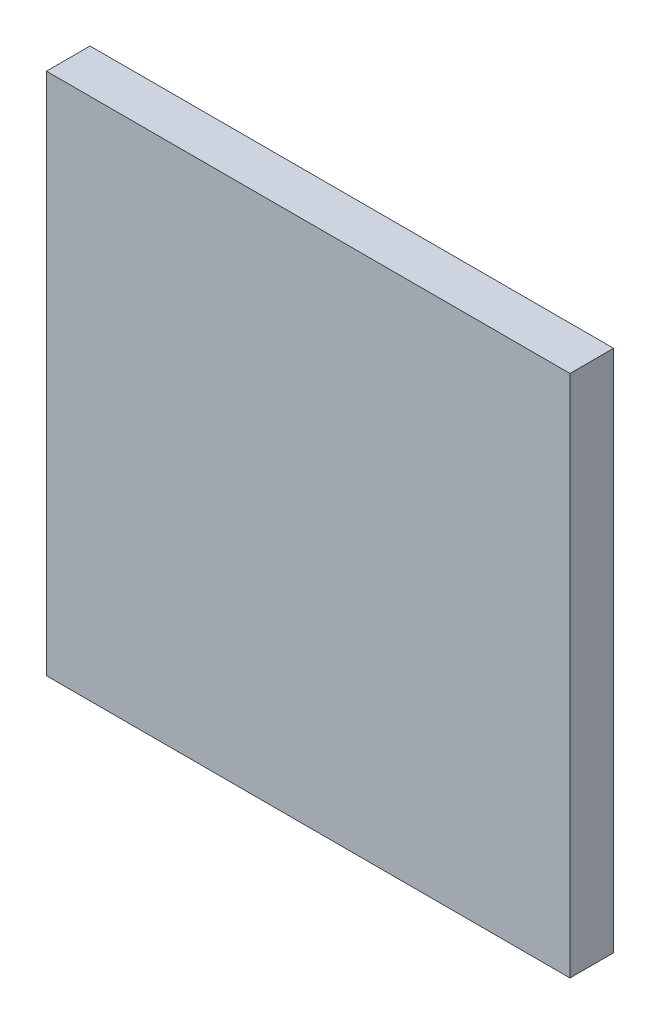
ISO-10303-21;
HEADER;
FILE_DESCRIPTION(('STEP AP214'),'2;1');
FILE_NAME('part.step','',(''),(''),'','','');
FILE_SCHEMA(('AUTOMOTIVE_DESIGN { 1 0 10303 214 1 1 1 1 }'));
ENDSEC;
DATA;
#1=APPLICATION_CONTEXT('core data for automotive mechanical design processes');
#2=APPLICATION_PROTOCOL_DEFINITION('international standard','automotive_design',2000,#1);
#3=PRODUCT_CONTEXT('',#1,'mechanical');
#4=PRODUCT('Part','Part','',(#3));
#5=PRODUCT_RELATED_PRODUCT_CATEGORY('part','',(#4));
#6=PRODUCT_DEFINITION_FORMATION('','',#4);
#7=PRODUCT_DEFINITION_CONTEXT('part definition',#1,'design');
#8=PRODUCT_DEFINITION('design','',#6,#7);
#9=PRODUCT_DEFINITION_SHAPE('','',#8);
#10=(LENGTH_UNIT() NAMED_UNIT(*) SI_UNIT(.MILLI.,.METRE.));
#11=(NAMED_UNIT(*) PLANE_ANGLE_UNIT() SI_UNIT($,.RADIAN.));
#12=(NAMED_UNIT(*) SI_UNIT($,.STERADIAN.) SOLID_ANGLE_UNIT());
#13=UNCERTAINTY_MEASURE_WITH_UNIT(LENGTH_MEASURE(1.E-05),#10,'distance_accuracy_value','');
#14=(GEOMETRIC_REPRESENTATION_CONTEXT(3) GLOBAL_UNCERTAINTY_ASSIGNED_CONTEXT((#13)) GLOBAL_UNIT_ASSIGNED_CONTEXT((#10,
#11,#12)) REPRESENTATION_CONTEXT('',''));
#15=CARTESIAN_POINT('',(0.,0.,0.));
#16=DIRECTION('',(0.,0.,1.));
#17=DIRECTION('',(1.,0.,0.));
#18=AXIS2_PLACEMENT_3D('',#15,#16,#17);
#19=CARTESIAN_POINT('',(25.7038565596707,12.9961425753169,1.6));
#20=DIRECTION('',(0.,0.,1.));
#21=DIRECTION('',(1.,0.,0.));
#22=AXIS2_PLACEMENT_3D('',#19,#20,#21);
#23=PLANE('',#22);
#24=DIRECTION('',(-1.,0.,0.));
#25=VECTOR('',#24,1.);
#26=CARTESIAN_POINT('',(31.7077135596707,6.99228557531691,1.6));
#27=LINE('',#26,#25);
#28=CARTESIAN_POINT('',(31.7077135596707,6.99228557531691,1.6));
#29=VERTEX_POINT('',#28);
#30=CARTESIAN_POINT('',(19.6999995596707,6.99228557531691,1.6));
#31=VERTEX_POINT('',#30);
#32=EDGE_CURVE('E28',#29,#31,#27,.T.);
#33=ORIENTED_EDGE('',*,*,#32,.T.);
#34=DIRECTION('',(0.,1.,0.));
#35=VECTOR('',#34,1.);
#36=CARTESIAN_POINT('',(19.6999995596707,6.99228557531691,1.6));
#37=LINE('',#36,#35);
#38=CARTESIAN_POINT('',(19.6999995596707,18.9999995753169,1.6));
#39=VERTEX_POINT('',#38);
#40=EDGE_CURVE('E88',#31,#39,#37,.T.);
#41=ORIENTED_EDGE('',*,*,#40,.T.);
#42=DIRECTION('',(1.,0.,0.));
#43=VECTOR('',#42,1.);
#44=CARTESIAN_POINT('',(19.6999995596707,18.9999995753169,1.6));
#45=LINE('',#44,#43);
#46=CARTESIAN_POINT('',(31.7077135596707,18.9999995753169,1.6));
#47=VERTEX_POINT('',#46);
#48=EDGE_CURVE('E81',#39,#47,#45,.T.);
#49=ORIENTED_EDGE('',*,*,#48,.T.);
#50=DIRECTION('',(0.,-1.,0.));
#51=VECTOR('',#50,1.);
#52=CARTESIAN_POINT('',(31.7077135596707,18.9999995753169,1.6));
#53=LINE('',#52,#51);
#54=EDGE_CURVE('E21',#47,#29,#53,.T.);
#55=ORIENTED_EDGE('',*,*,#54,.T.);
#56=EDGE_LOOP('',(#33,#41,#49,#55));
#57=FACE_BOUND('',#56,.T.);
#58=ADVANCED_FACE('F17',(#57),#23,.F.);
#59=CARTESIAN_POINT('',(25.7038565596707,12.9961425753169,2.6));
#60=DIRECTION('',(0.,0.,1.));
#61=DIRECTION('',(1.,0.,0.));
#62=AXIS2_PLACEMENT_3D('',#59,#60,#61);
#63=PLANE('',#62);
#64=DIRECTION('',(1.,0.,0.));
#65=VECTOR('',#64,1.);
#66=CARTESIAN_POINT('',(31.7077135596707,6.99228557531691,2.6));
#67=LINE('',#66,#65);
#68=CARTESIAN_POINT('',(19.6999995596707,6.99228557531691,2.6));
#69=VERTEX_POINT('',#68);
#70=CARTESIAN_POINT('',(31.7077135596707,6.99228557531691,2.6));
#71=VERTEX_POINT('',#70);
#72=EDGE_CURVE('E11',#69,#71,#67,.T.);
#73=ORIENTED_EDGE('',*,*,#72,.T.);
#74=DIRECTION('',(0.,1.,0.));
#75=VECTOR('',#74,1.);
#76=CARTESIAN_POINT('',(31.7077135596707,18.9999995753169,2.6));
#77=LINE('',#76,#75);
#78=CARTESIAN_POINT('',(31.7077135596707,18.9999995753169,2.6));
#79=VERTEX_POINT('',#78);
#80=EDGE_CURVE('E77',#71,#79,#77,.T.);
#81=ORIENTED_EDGE('',*,*,#80,.T.);
#82=DIRECTION('',(-1.,0.,0.));
#83=VECTOR('',#82,1.);
#84=CARTESIAN_POINT('',(19.6999995596707,18.9999995753169,2.6));
#85=LINE('',#84,#83);
#86=CARTESIAN_POINT('',(19.6999995596707,18.9999995753169,2.6));
#87=VERTEX_POINT('',#86);
#88=EDGE_CURVE('E83',#79,#87,#85,.T.);
#89=ORIENTED_EDGE('',*,*,#88,.T.);
#90=DIRECTION('',(0.,-1.,0.));
#91=VECTOR('',#90,1.);
#92=CARTESIAN_POINT('',(19.6999995596707,6.99228557531691,2.6));
#93=LINE('',#92,#91);
#94=EDGE_CURVE('E98',#87,#69,#93,.T.);
#95=ORIENTED_EDGE('',*,*,#94,.T.);
#96=EDGE_LOOP('',(#73,#81,#89,#95));
#97=FACE_BOUND('',#96,.T.);
#98=ADVANCED_FACE('F163',(#97),#63,.T.);
#99=CARTESIAN_POINT('',(19.6999995596707,6.99228557531691,1.6));
#100=DIRECTION('',(0.,-1.,0.));
#101=DIRECTION('',(0.,0.,-1.));
#102=AXIS2_PLACEMENT_3D('',#99,#100,#101);
#103=PLANE('',#102);
#104=ORIENTED_EDGE('',*,*,#32,.F.);
#105=DIRECTION('',(0.,0.,1.));
#106=VECTOR('',#105,1.);
#107=CARTESIAN_POINT('',(31.7077135596707,6.99228557531691,1.6));
#108=LINE('',#107,#106);
#109=EDGE_CURVE('E72',#29,#71,#108,.T.);
#110=ORIENTED_EDGE('',*,*,#109,.T.);
#111=ORIENTED_EDGE('',*,*,#72,.F.);
#112=DIRECTION('',(0.,0.,1.));
#113=VECTOR('',#112,1.);
#114=CARTESIAN_POINT('',(19.6999995596707,6.99228557531691,1.6));
#115=LINE('',#114,#113);
#116=EDGE_CURVE('E105',#31,#69,#115,.T.);
#117=ORIENTED_EDGE('',*,*,#116,.F.);
#118=EDGE_LOOP('',(#104,#110,#111,#117));
#119=FACE_BOUND('',#118,.T.);
#120=ADVANCED_FACE('F19',(#119),#103,.T.);
#121=CARTESIAN_POINT('',(31.7077135596707,6.99228557531691,1.6));
#122=DIRECTION('',(1.,0.,0.));
#123=DIRECTION('',(0.,1.,0.));
#124=AXIS2_PLACEMENT_3D('',#121,#122,#123);
#125=PLANE('',#124);
#126=ORIENTED_EDGE('',*,*,#54,.F.);
#127=DIRECTION('',(0.,0.,1.));
#128=VECTOR('',#127,1.);
#129=CARTESIAN_POINT('',(31.7077135596707,18.9999995753169,1.6));
#130=LINE('',#129,#128);
#131=EDGE_CURVE('E70',#47,#79,#130,.T.);
#132=ORIENTED_EDGE('',*,*,#131,.T.);
#133=ORIENTED_EDGE('',*,*,#80,.F.);
#134=ORIENTED_EDGE('',*,*,#109,.F.);
#135=EDGE_LOOP('',(#126,#132,#133,#134));
#136=FACE_BOUND('',#135,.T.);
#137=ADVANCED_FACE('F68',(#136),#125,.T.);
#138=CARTESIAN_POINT('',(31.7077135596707,18.9999995753169,1.6));
#139=DIRECTION('',(0.,1.,0.));
#140=DIRECTION('',(1.,0.,0.));
#141=AXIS2_PLACEMENT_3D('',#138,#139,#140);
#142=PLANE('',#141);
#143=ORIENTED_EDGE('',*,*,#48,.F.);
#144=DIRECTION('',(0.,0.,1.));
#145=VECTOR('',#144,1.);
#146=CARTESIAN_POINT('',(19.6999995596707,18.9999995753169,1.6));
#147=LINE('',#146,#145);
#148=EDGE_CURVE('E90',#39,#87,#147,.T.);
#149=ORIENTED_EDGE('',*,*,#148,.T.);
#150=ORIENTED_EDGE('',*,*,#88,.F.);
#151=ORIENTED_EDGE('',*,*,#131,.F.);
#152=EDGE_LOOP('',(#143,#149,#150,#151));
#153=FACE_BOUND('',#152,.T.);
#154=ADVANCED_FACE('F79',(#153),#142,.T.);
#155=CARTESIAN_POINT('',(19.6999995596707,18.9999995753169,1.6));
#156=DIRECTION('',(-1.,0.,0.));
#157=DIRECTION('',(0.,0.,1.));
#158=AXIS2_PLACEMENT_3D('',#155,#156,#157);
#159=PLANE('',#158);
#160=ORIENTED_EDGE('',*,*,#40,.F.);
#161=ORIENTED_EDGE('',*,*,#116,.T.);
#162=ORIENTED_EDGE('',*,*,#94,.F.);
#163=ORIENTED_EDGE('',*,*,#148,.F.);
#164=EDGE_LOOP('',(#160,#161,#162,#163));
#165=FACE_BOUND('',#164,.T.);
#166=ADVANCED_FACE('F196',(#165),#159,.T.);
#167=CLOSED_SHELL('',(#58,#98,#120,#137,#154,#166));
#168=MANIFOLD_SOLID_BREP('B1',#167);
#169=ADVANCED_BREP_SHAPE_REPRESENTATION('',(#18,#168),#14);
#170=SHAPE_DEFINITION_REPRESENTATION(#9,#169);
ENDSEC;
END-ISO-10303-21;
